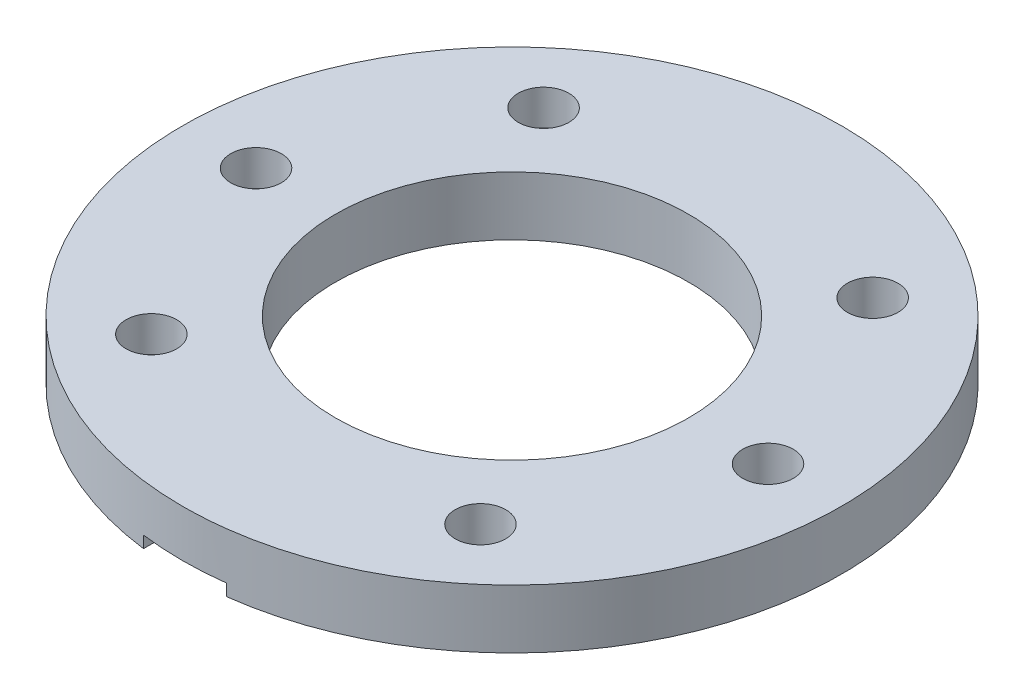
ISO-10303-21;
HEADER;
FILE_DESCRIPTION(('STEP AP214'),'2;1');
FILE_NAME('part.step','',(''),(''),'','','');
FILE_SCHEMA(('AUTOMOTIVE_DESIGN { 1 0 10303 214 1 1 1 1 }'));
ENDSEC;
DATA;
#1=APPLICATION_CONTEXT('core data for automotive mechanical design processes');
#2=APPLICATION_PROTOCOL_DEFINITION('international standard','automotive_design',2000,#1);
#3=PRODUCT_CONTEXT('',#1,'mechanical');
#4=PRODUCT('Part','Part','',(#3));
#5=PRODUCT_RELATED_PRODUCT_CATEGORY('part','',(#4));
#6=PRODUCT_DEFINITION_FORMATION('','',#4);
#7=PRODUCT_DEFINITION_CONTEXT('part definition',#1,'design');
#8=PRODUCT_DEFINITION('design','',#6,#7);
#9=PRODUCT_DEFINITION_SHAPE('','',#8);
#10=(LENGTH_UNIT() NAMED_UNIT(*) SI_UNIT(.MILLI.,.METRE.));
#11=(NAMED_UNIT(*) PLANE_ANGLE_UNIT() SI_UNIT($,.RADIAN.));
#12=(NAMED_UNIT(*) SI_UNIT($,.STERADIAN.) SOLID_ANGLE_UNIT());
#13=UNCERTAINTY_MEASURE_WITH_UNIT(LENGTH_MEASURE(1.E-05),#10,'distance_accuracy_value','');
#14=(GEOMETRIC_REPRESENTATION_CONTEXT(3) GLOBAL_UNCERTAINTY_ASSIGNED_CONTEXT((#13)) GLOBAL_UNIT_ASSIGNED_CONTEXT((#10,
#11,#12)) REPRESENTATION_CONTEXT('',''));
#15=CARTESIAN_POINT('',(0.,0.,0.));
#16=DIRECTION('',(0.,0.,1.));
#17=DIRECTION('',(1.,0.,0.));
#18=AXIS2_PLACEMENT_3D('',#15,#16,#17);
#19=CARTESIAN_POINT('',(-13.9806305106823,5.,16.6614666378378));
#20=DIRECTION('',(0.,-1.,0.));
#21=DIRECTION('',(0.,0.,-1.));
#22=AXIS2_PLACEMENT_3D('',#19,#20,#21);
#23=CYLINDRICAL_SURFACE('',#22,2.15);
#24=CARTESIAN_POINT('',(-13.9806305106823,5.,16.6614666378378));
#25=DIRECTION('',(0.,1.,0.));
#26=DIRECTION('',(0.,0.,1.));
#27=AXIS2_PLACEMENT_3D('',#24,#25,#26);
#28=CIRCLE('',#27,2.15);
#29=CARTESIAN_POINT('',(-13.9806305106823,5.,18.8114666378377));
#30=VERTEX_POINT('',#29);
#31=EDGE_CURVE('E234',#30,#30,#28,.T.);
#32=ORIENTED_EDGE('',*,*,#31,.T.);
#33=EDGE_LOOP('',(#32));
#34=FACE_BOUND('',#33,.T.);
#35=CARTESIAN_POINT('',(-13.9806305106823,2.,16.6614666378378));
#36=DIRECTION('',(0.,-1.,0.));
#37=DIRECTION('',(0.,0.,-1.));
#38=AXIS2_PLACEMENT_3D('',#35,#36,#37);
#39=CIRCLE('',#38,2.15);
#40=CARTESIAN_POINT('',(-13.9806305106823,2.,14.5114666378378));
#41=VERTEX_POINT('',#40);
#42=EDGE_CURVE('E43',#41,#41,#39,.T.);
#43=ORIENTED_EDGE('',*,*,#42,.T.);
#44=EDGE_LOOP('',(#43));
#45=FACE_BOUND('',#44,.T.);
#46=ADVANCED_FACE('F39',(#34,#45),#23,.F.);
#47=CARTESIAN_POINT('',(-21.75,5.,0.));
#48=DIRECTION('',(0.,-1.,0.));
#49=DIRECTION('',(0.,0.,-1.));
#50=AXIS2_PLACEMENT_3D('',#47,#48,#49);
#51=CYLINDRICAL_SURFACE('',#50,2.15);
#52=CARTESIAN_POINT('',(-21.75,5.,0.));
#53=DIRECTION('',(0.,1.,0.));
#54=DIRECTION('',(0.,0.,-1.));
#55=AXIS2_PLACEMENT_3D('',#52,#53,#54);
#56=CIRCLE('',#55,2.15);
#57=CARTESIAN_POINT('',(-21.75,5.,-2.15));
#58=VERTEX_POINT('',#57);
#59=EDGE_CURVE('E230',#58,#58,#56,.T.);
#60=ORIENTED_EDGE('',*,*,#59,.T.);
#61=EDGE_LOOP('',(#60));
#62=FACE_BOUND('',#61,.T.);
#63=CARTESIAN_POINT('',(-21.75,2.,0.));
#64=DIRECTION('',(0.,-1.,0.));
#65=DIRECTION('',(0.,0.,-1.));
#66=AXIS2_PLACEMENT_3D('',#63,#64,#65);
#67=CIRCLE('',#66,2.15);
#68=CARTESIAN_POINT('',(-21.75,2.,-2.15));
#69=VERTEX_POINT('',#68);
#70=EDGE_CURVE('E201',#69,#69,#67,.T.);
#71=ORIENTED_EDGE('',*,*,#70,.T.);
#72=EDGE_LOOP('',(#71));
#73=FACE_BOUND('',#72,.T.);
#74=ADVANCED_FACE('F105',(#62,#73),#51,.F.);
#75=CARTESIAN_POINT('',(-13.9806305106823,5.,-16.6614666378378));
#76=DIRECTION('',(0.,-1.,0.));
#77=DIRECTION('',(0.,0.,-1.));
#78=AXIS2_PLACEMENT_3D('',#75,#76,#77);
#79=CYLINDRICAL_SURFACE('',#78,2.15);
#80=CARTESIAN_POINT('',(-13.9806305106823,5.,-16.6614666378378));
#81=DIRECTION('',(0.,1.,0.));
#82=DIRECTION('',(0.,0.,-1.));
#83=AXIS2_PLACEMENT_3D('',#80,#81,#82);
#84=CIRCLE('',#83,2.15);
#85=CARTESIAN_POINT('',(-13.9806305106823,5.,-18.8114666378377));
#86=VERTEX_POINT('',#85);
#87=EDGE_CURVE('E220',#86,#86,#84,.T.);
#88=ORIENTED_EDGE('',*,*,#87,.T.);
#89=EDGE_LOOP('',(#88));
#90=FACE_BOUND('',#89,.T.);
#91=CARTESIAN_POINT('',(-13.9806305106823,2.,-16.6614666378378));
#92=DIRECTION('',(0.,-1.,0.));
#93=DIRECTION('',(0.,0.,-1.));
#94=AXIS2_PLACEMENT_3D('',#91,#92,#93);
#95=CIRCLE('',#94,2.15);
#96=CARTESIAN_POINT('',(-13.9806305106823,2.,-18.8114666378377));
#97=VERTEX_POINT('',#96);
#98=EDGE_CURVE('E198',#97,#97,#95,.T.);
#99=ORIENTED_EDGE('',*,*,#98,.T.);
#100=EDGE_LOOP('',(#99));
#101=FACE_BOUND('',#100,.T.);
#102=ADVANCED_FACE('F111',(#90,#101),#79,.F.);
#103=CARTESIAN_POINT('',(0.,0.,0.));
#104=DIRECTION('',(0.,1.,0.));
#105=DIRECTION('',(0.,0.,1.));
#106=AXIS2_PLACEMENT_3D('',#103,#104,#105);
#107=PLANE('',#106);
#108=CARTESIAN_POINT('',(-13.9806305106823,0.,-16.6614666378378));
#109=DIRECTION('',(0.,-1.,0.));
#110=DIRECTION('',(0.,0.,-1.));
#111=AXIS2_PLACEMENT_3D('',#108,#109,#110);
#112=CIRCLE('',#111,5.);
#113=CARTESIAN_POINT('',(-13.9806305106823,0.,-21.6614666378378));
#114=VERTEX_POINT('',#113);
#115=EDGE_CURVE('E150',#114,#114,#112,.T.);
#116=ORIENTED_EDGE('',*,*,#115,.F.);
#117=EDGE_LOOP('',(#116));
#118=FACE_BOUND('',#117,.T.);
#119=CARTESIAN_POINT('',(-21.75,0.,0.));
#120=DIRECTION('',(0.,-1.,0.));
#121=DIRECTION('',(0.,0.,-1.));
#122=AXIS2_PLACEMENT_3D('',#119,#120,#121);
#123=CIRCLE('',#122,5.);
#124=CARTESIAN_POINT('',(-21.75,0.,-5.));
#125=VERTEX_POINT('',#124);
#126=EDGE_CURVE('E154',#125,#125,#123,.T.);
#127=ORIENTED_EDGE('',*,*,#126,.F.);
#128=EDGE_LOOP('',(#127));
#129=FACE_BOUND('',#128,.T.);
#130=CARTESIAN_POINT('',(-13.9806305106823,0.,16.6614666378378));
#131=DIRECTION('',(0.,-1.,0.));
#132=DIRECTION('',(0.,0.,-1.));
#133=AXIS2_PLACEMENT_3D('',#130,#131,#132);
#134=CIRCLE('',#133,5.);
#135=CARTESIAN_POINT('',(-13.9806305106823,0.,11.6614666378377));
#136=VERTEX_POINT('',#135);
#137=EDGE_CURVE('E158',#136,#136,#134,.T.);
#138=ORIENTED_EDGE('',*,*,#137,.F.);
#139=EDGE_LOOP('',(#138));
#140=FACE_BOUND('',#139,.T.);
#141=CARTESIAN_POINT('',(13.9806305106823,0.,16.6614666378378));
#142=DIRECTION('',(0.,1.,0.));
#143=DIRECTION('',(0.,0.,-1.));
#144=AXIS2_PLACEMENT_3D('',#141,#142,#143);
#145=CIRCLE('',#144,2.15);
#146=CARTESIAN_POINT('',(13.9806305106823,0.,14.5114666378378));
#147=VERTEX_POINT('',#146);
#148=EDGE_CURVE('E162',#147,#147,#145,.T.);
#149=ORIENTED_EDGE('',*,*,#148,.T.);
#150=EDGE_LOOP('',(#149));
#151=FACE_BOUND('',#150,.T.);
#152=CARTESIAN_POINT('',(21.75,0.,0.));
#153=DIRECTION('',(0.,1.,0.));
#154=DIRECTION('',(0.,0.,1.));
#155=AXIS2_PLACEMENT_3D('',#152,#153,#154);
#156=CIRCLE('',#155,2.15);
#157=CARTESIAN_POINT('',(21.75,0.,2.15));
#158=VERTEX_POINT('',#157);
#159=EDGE_CURVE('E166',#158,#158,#156,.T.);
#160=ORIENTED_EDGE('',*,*,#159,.T.);
#161=EDGE_LOOP('',(#160));
#162=FACE_BOUND('',#161,.T.);
#163=CARTESIAN_POINT('',(13.9806305106823,0.,-16.6614666378378));
#164=DIRECTION('',(0.,1.,0.));
#165=DIRECTION('',(0.,0.,1.));
#166=AXIS2_PLACEMENT_3D('',#163,#164,#165);
#167=CIRCLE('',#166,2.15);
#168=CARTESIAN_POINT('',(13.9806305106823,0.,-14.5114666378378));
#169=VERTEX_POINT('',#168);
#170=EDGE_CURVE('E170',#169,#169,#167,.T.);
#171=ORIENTED_EDGE('',*,*,#170,.T.);
#172=EDGE_LOOP('',(#171));
#173=FACE_BOUND('',#172,.T.);
#174=CARTESIAN_POINT('',(0.,0.,0.));
#175=DIRECTION('',(0.,1.,0.));
#176=DIRECTION('',(0.,0.,1.));
#177=AXIS2_PLACEMENT_3D('',#174,#175,#176);
#178=CIRCLE('',#177,15.);
#179=CARTESIAN_POINT('',(0.,0.,15.));
#180=VERTEX_POINT('',#179);
#181=EDGE_CURVE('E174',#180,#180,#178,.T.);
#182=ORIENTED_EDGE('',*,*,#181,.T.);
#183=EDGE_LOOP('',(#182));
#184=FACE_BOUND('',#183,.T.);
#185=DIRECTION('',(0.,0.,1.));
#186=VECTOR('',#185,1.);
#187=CARTESIAN_POINT('',(-3.53553390593271,0.,0.));
#188=LINE('',#187,#186);
#189=CARTESIAN_POINT('',(-3.53553390593271,0.,26.5355339059328));
#190=VERTEX_POINT('',#189);
#191=CARTESIAN_POINT('',(-3.53553390593271,0.,27.7758888246623));
#192=VERTEX_POINT('',#191);
#193=EDGE_CURVE('E83',#190,#192,#188,.T.);
#194=ORIENTED_EDGE('',*,*,#193,.T.);
#195=CARTESIAN_POINT('',(0.,0.,0.));
#196=DIRECTION('',(0.,1.,0.));
#197=DIRECTION('',(0.,0.,1.));
#198=AXIS2_PLACEMENT_3D('',#195,#196,#197);
#199=CIRCLE('',#198,28.);
#200=CARTESIAN_POINT('',(3.53553390593278,0.,27.7758888246623));
#201=VERTEX_POINT('',#200);
#202=EDGE_CURVE('E49',#201,#192,#199,.T.);
#203=ORIENTED_EDGE('',*,*,#202,.F.);
#204=DIRECTION('',(0.,0.,1.));
#205=VECTOR('',#204,1.);
#206=CARTESIAN_POINT('',(3.53553390593278,0.,0.));
#207=LINE('',#206,#205);
#208=CARTESIAN_POINT('',(3.53553390593278,0.,26.5355339059327));
#209=VERTEX_POINT('',#208);
#210=EDGE_CURVE('E182',#209,#201,#207,.T.);
#211=ORIENTED_EDGE('',*,*,#210,.F.);
#212=CARTESIAN_POINT('',(0.,0.,23.));
#213=DIRECTION('',(0.,-1.,0.));
#214=DIRECTION('',(0.,0.,-1.));
#215=AXIS2_PLACEMENT_3D('',#212,#213,#214);
#216=CIRCLE('',#215,5.);
#217=EDGE_CURVE('E179',#209,#190,#216,.F.);
#218=ORIENTED_EDGE('',*,*,#217,.T.);
#219=EDGE_LOOP('',(#194,#203,#211,#218));
#220=FACE_BOUND('',#219,.T.);
#221=ADVANCED_FACE('F138',(#118,#129,#140,#151,#162,#173,#184,#220),#107,.F.);
#222=CARTESIAN_POINT('',(0.,5.,0.));
#223=DIRECTION('',(0.,-1.,0.));
#224=DIRECTION('',(0.,0.,-1.));
#225=AXIS2_PLACEMENT_3D('',#222,#223,#224);
#226=CYLINDRICAL_SURFACE('',#225,28.);
#227=CARTESIAN_POINT('',(0.,5.,0.));
#228=DIRECTION('',(0.,1.,0.));
#229=DIRECTION('',(0.,0.,1.));
#230=AXIS2_PLACEMENT_3D('',#227,#228,#229);
#231=CIRCLE('',#230,28.);
#232=CARTESIAN_POINT('',(0.,5.,28.));
#233=VERTEX_POINT('',#232);
#234=EDGE_CURVE('E11',#233,#233,#231,.T.);
#235=ORIENTED_EDGE('',*,*,#234,.F.);
#236=EDGE_LOOP('',(#235));
#237=FACE_BOUND('',#236,.T.);
#238=DIRECTION('',(0.,-1.,0.));
#239=VECTOR('',#238,1.);
#240=CARTESIAN_POINT('',(-3.53553390593271,1.,27.7758888246623));
#241=LINE('',#240,#239);
#242=CARTESIAN_POINT('',(-3.53553390593271,1.,27.7758888246623));
#243=VERTEX_POINT('',#242);
#244=EDGE_CURVE('E188',#243,#192,#241,.T.);
#245=ORIENTED_EDGE('',*,*,#244,.F.);
#246=CARTESIAN_POINT('',(0.,1.,0.));
#247=DIRECTION('',(0.,-1.,0.));
#248=DIRECTION('',(0.,0.,-1.));
#249=AXIS2_PLACEMENT_3D('',#246,#247,#248);
#250=CIRCLE('',#249,28.);
#251=CARTESIAN_POINT('',(3.53553390593278,1.,27.7758888246623));
#252=VERTEX_POINT('',#251);
#253=EDGE_CURVE('E257',#252,#243,#250,.T.);
#254=ORIENTED_EDGE('',*,*,#253,.F.);
#255=DIRECTION('',(0.,-1.,0.));
#256=VECTOR('',#255,1.);
#257=CARTESIAN_POINT('',(3.53553390593278,1.,27.7758888246623));
#258=LINE('',#257,#256);
#259=EDGE_CURVE('E189',#252,#201,#258,.T.);
#260=ORIENTED_EDGE('',*,*,#259,.T.);
#261=ORIENTED_EDGE('',*,*,#202,.T.);
#262=EDGE_LOOP('',(#245,#254,#260,#261));
#263=FACE_BOUND('',#262,.T.);
#264=ADVANCED_FACE('F41',(#237,#263),#226,.T.);
#265=CARTESIAN_POINT('',(0.,5.,0.));
#266=DIRECTION('',(0.,1.,0.));
#267=DIRECTION('',(0.,0.,1.));
#268=AXIS2_PLACEMENT_3D('',#265,#266,#267);
#269=PLANE('',#268);
#270=ORIENTED_EDGE('',*,*,#59,.F.);
#271=EDGE_LOOP('',(#270));
#272=FACE_BOUND('',#271,.T.);
#273=CARTESIAN_POINT('',(13.9806305106823,5.,16.6614666378378));
#274=DIRECTION('',(0.,1.,0.));
#275=DIRECTION('',(0.,0.,-1.));
#276=AXIS2_PLACEMENT_3D('',#273,#274,#275);
#277=CIRCLE('',#276,2.15);
#278=CARTESIAN_POINT('',(13.9806305106823,5.,14.5114666378378));
#279=VERTEX_POINT('',#278);
#280=EDGE_CURVE('E237',#279,#279,#277,.T.);
#281=ORIENTED_EDGE('',*,*,#280,.F.);
#282=EDGE_LOOP('',(#281));
#283=FACE_BOUND('',#282,.T.);
#284=CARTESIAN_POINT('',(13.9806305106823,5.,-16.6614666378378));
#285=DIRECTION('',(0.,1.,0.));
#286=DIRECTION('',(0.,0.,1.));
#287=AXIS2_PLACEMENT_3D('',#284,#285,#286);
#288=CIRCLE('',#287,2.15);
#289=CARTESIAN_POINT('',(13.9806305106823,5.,-14.5114666378378));
#290=VERTEX_POINT('',#289);
#291=EDGE_CURVE('E249',#290,#290,#288,.T.);
#292=ORIENTED_EDGE('',*,*,#291,.F.);
#293=EDGE_LOOP('',(#292));
#294=FACE_BOUND('',#293,.T.);
#295=ORIENTED_EDGE('',*,*,#234,.T.);
#296=EDGE_LOOP('',(#295));
#297=FACE_BOUND('',#296,.T.);
#298=CARTESIAN_POINT('',(0.,5.,0.));
#299=DIRECTION('',(0.,1.,0.));
#300=DIRECTION('',(0.,0.,1.));
#301=AXIS2_PLACEMENT_3D('',#298,#299,#300);
#302=CIRCLE('',#301,15.);
#303=CARTESIAN_POINT('',(0.,5.,15.));
#304=VERTEX_POINT('',#303);
#305=EDGE_CURVE('E191',#304,#304,#302,.T.);
#306=ORIENTED_EDGE('',*,*,#305,.F.);
#307=EDGE_LOOP('',(#306));
#308=FACE_BOUND('',#307,.T.);
#309=CARTESIAN_POINT('',(21.75,5.,0.));
#310=DIRECTION('',(0.,1.,0.));
#311=DIRECTION('',(0.,0.,1.));
#312=AXIS2_PLACEMENT_3D('',#309,#310,#311);
#313=CIRCLE('',#312,2.15);
#314=CARTESIAN_POINT('',(21.75,5.,2.15));
#315=VERTEX_POINT('',#314);
#316=EDGE_CURVE('E243',#315,#315,#313,.T.);
#317=ORIENTED_EDGE('',*,*,#316,.F.);
#318=EDGE_LOOP('',(#317));
#319=FACE_BOUND('',#318,.T.);
#320=ORIENTED_EDGE('',*,*,#31,.F.);
#321=EDGE_LOOP('',(#320));
#322=FACE_BOUND('',#321,.T.);
#323=ORIENTED_EDGE('',*,*,#87,.F.);
#324=EDGE_LOOP('',(#323));
#325=FACE_BOUND('',#324,.T.);
#326=ADVANCED_FACE('F134',(#272,#283,#294,#297,#308,#319,#322,#325),#269,.T.);
#327=CARTESIAN_POINT('',(0.,5.,0.));
#328=DIRECTION('',(0.,-1.,0.));
#329=DIRECTION('',(0.,0.,-1.));
#330=AXIS2_PLACEMENT_3D('',#327,#328,#329);
#331=CYLINDRICAL_SURFACE('',#330,15.);
#332=ORIENTED_EDGE('',*,*,#305,.T.);
#333=EDGE_LOOP('',(#332));
#334=FACE_BOUND('',#333,.T.);
#335=ORIENTED_EDGE('',*,*,#181,.F.);
#336=EDGE_LOOP('',(#335));
#337=FACE_BOUND('',#336,.T.);
#338=ADVANCED_FACE('F130',(#334,#337),#331,.F.);
#339=CARTESIAN_POINT('',(13.9806305106823,5.,-16.6614666378378));
#340=DIRECTION('',(0.,-1.,0.));
#341=DIRECTION('',(0.,0.,-1.));
#342=AXIS2_PLACEMENT_3D('',#339,#340,#341);
#343=CYLINDRICAL_SURFACE('',#342,2.15);
#344=ORIENTED_EDGE('',*,*,#291,.T.);
#345=EDGE_LOOP('',(#344));
#346=FACE_BOUND('',#345,.T.);
#347=ORIENTED_EDGE('',*,*,#170,.F.);
#348=EDGE_LOOP('',(#347));
#349=FACE_BOUND('',#348,.T.);
#350=ADVANCED_FACE('F126',(#346,#349),#343,.F.);
#351=CARTESIAN_POINT('',(21.75,5.,0.));
#352=DIRECTION('',(0.,-1.,0.));
#353=DIRECTION('',(0.,0.,-1.));
#354=AXIS2_PLACEMENT_3D('',#351,#352,#353);
#355=CYLINDRICAL_SURFACE('',#354,2.15);
#356=ORIENTED_EDGE('',*,*,#316,.T.);
#357=EDGE_LOOP('',(#356));
#358=FACE_BOUND('',#357,.T.);
#359=ORIENTED_EDGE('',*,*,#159,.F.);
#360=EDGE_LOOP('',(#359));
#361=FACE_BOUND('',#360,.T.);
#362=ADVANCED_FACE('F122',(#358,#361),#355,.F.);
#363=CARTESIAN_POINT('',(13.9806305106823,5.,16.6614666378378));
#364=DIRECTION('',(0.,-1.,0.));
#365=DIRECTION('',(0.,0.,-1.));
#366=AXIS2_PLACEMENT_3D('',#363,#364,#365);
#367=CYLINDRICAL_SURFACE('',#366,2.15);
#368=ORIENTED_EDGE('',*,*,#280,.T.);
#369=EDGE_LOOP('',(#368));
#370=FACE_BOUND('',#369,.T.);
#371=ORIENTED_EDGE('',*,*,#148,.F.);
#372=EDGE_LOOP('',(#371));
#373=FACE_BOUND('',#372,.T.);
#374=ADVANCED_FACE('F118',(#370,#373),#367,.F.);
#375=CARTESIAN_POINT('',(0.,1.,23.));
#376=DIRECTION('',(0.,-1.,0.));
#377=DIRECTION('',(0.,0.,-1.));
#378=AXIS2_PLACEMENT_3D('',#375,#376,#377);
#379=CYLINDRICAL_SURFACE('',#378,5.);
#380=ORIENTED_EDGE('',*,*,#217,.F.);
#381=DIRECTION('',(0.,-1.,0.));
#382=VECTOR('',#381,1.);
#383=CARTESIAN_POINT('',(3.53553390593278,1.,26.5355339059327));
#384=LINE('',#383,#382);
#385=CARTESIAN_POINT('',(3.53553390593278,1.,26.5355339059327));
#386=VERTEX_POINT('',#385);
#387=EDGE_CURVE('E88',#386,#209,#384,.T.);
#388=ORIENTED_EDGE('',*,*,#387,.F.);
#389=CARTESIAN_POINT('',(0.,1.,23.));
#390=DIRECTION('',(0.,-1.,0.));
#391=DIRECTION('',(0.,0.,-1.));
#392=AXIS2_PLACEMENT_3D('',#389,#390,#391);
#393=CIRCLE('',#392,5.);
#394=CARTESIAN_POINT('',(-3.53553390593271,1.,26.5355339059328));
#395=VERTEX_POINT('',#394);
#396=EDGE_CURVE('E181',#386,#395,#393,.F.);
#397=ORIENTED_EDGE('',*,*,#396,.T.);
#398=DIRECTION('',(0.,-1.,0.));
#399=VECTOR('',#398,1.);
#400=CARTESIAN_POINT('',(-3.53553390593271,1.,26.5355339059328));
#401=LINE('',#400,#399);
#402=EDGE_CURVE('E217',#395,#190,#401,.T.);
#403=ORIENTED_EDGE('',*,*,#402,.T.);
#404=EDGE_LOOP('',(#380,#388,#397,#403));
#405=FACE_BOUND('',#404,.T.);
#406=ADVANCED_FACE('F121',(#405),#379,.F.);
#407=CARTESIAN_POINT('',(-3.53553390593271,1.,0.));
#408=DIRECTION('',(1.,0.,0.));
#409=DIRECTION('',(0.,0.,-1.));
#410=AXIS2_PLACEMENT_3D('',#407,#408,#409);
#411=PLANE('',#410);
#412=ORIENTED_EDGE('',*,*,#193,.F.);
#413=ORIENTED_EDGE('',*,*,#402,.F.);
#414=DIRECTION('',(0.,0.,1.));
#415=VECTOR('',#414,1.);
#416=CARTESIAN_POINT('',(-3.53553390593271,1.,0.));
#417=LINE('',#416,#415);
#418=EDGE_CURVE('E63',#395,#243,#417,.T.);
#419=ORIENTED_EDGE('',*,*,#418,.T.);
#420=ORIENTED_EDGE('',*,*,#244,.T.);
#421=EDGE_LOOP('',(#412,#413,#419,#420));
#422=FACE_BOUND('',#421,.T.);
#423=ADVANCED_FACE('F296',(#422),#411,.T.);
#424=CARTESIAN_POINT('',(3.53553390593278,1.,0.));
#425=DIRECTION('',(1.,0.,0.));
#426=DIRECTION('',(0.,0.,-1.));
#427=AXIS2_PLACEMENT_3D('',#424,#425,#426);
#428=PLANE('',#427);
#429=ORIENTED_EDGE('',*,*,#210,.T.);
#430=ORIENTED_EDGE('',*,*,#259,.F.);
#431=DIRECTION('',(0.,0.,1.));
#432=VECTOR('',#431,1.);
#433=CARTESIAN_POINT('',(3.53553390593278,1.,0.));
#434=LINE('',#433,#432);
#435=EDGE_CURVE('E57',#386,#252,#434,.T.);
#436=ORIENTED_EDGE('',*,*,#435,.F.);
#437=ORIENTED_EDGE('',*,*,#387,.T.);
#438=EDGE_LOOP('',(#429,#430,#436,#437));
#439=FACE_BOUND('',#438,.T.);
#440=ADVANCED_FACE('F293',(#439),#428,.F.);
#441=CARTESIAN_POINT('',(0.,1.,0.));
#442=DIRECTION('',(0.,-1.,0.));
#443=DIRECTION('',(0.,0.,-1.));
#444=AXIS2_PLACEMENT_3D('',#441,#442,#443);
#445=PLANE('',#444);
#446=CARTESIAN_POINT('',(0.,1.,23.));
#447=DIRECTION('',(0.,-1.,0.));
#448=DIRECTION('',(0.,0.,-1.));
#449=AXIS2_PLACEMENT_3D('',#446,#447,#448);
#450=CIRCLE('',#449,4.5);
#451=CARTESIAN_POINT('',(0.,1.,18.5));
#452=VERTEX_POINT('',#451);
#453=EDGE_CURVE('E281',#452,#452,#450,.T.);
#454=ORIENTED_EDGE('',*,*,#453,.F.);
#455=EDGE_LOOP('',(#454));
#456=FACE_BOUND('',#455,.T.);
#457=ORIENTED_EDGE('',*,*,#396,.F.);
#458=ORIENTED_EDGE('',*,*,#435,.T.);
#459=ORIENTED_EDGE('',*,*,#253,.T.);
#460=ORIENTED_EDGE('',*,*,#418,.F.);
#461=EDGE_LOOP('',(#457,#458,#459,#460));
#462=FACE_BOUND('',#461,.T.);
#463=ADVANCED_FACE('F290',(#456,#462),#445,.T.);
#464=CARTESIAN_POINT('',(-13.9806305106823,2.,-16.6614666378378));
#465=DIRECTION('',(0.,-1.,0.));
#466=DIRECTION('',(0.,0.,-1.));
#467=AXIS2_PLACEMENT_3D('',#464,#465,#466);
#468=CYLINDRICAL_SURFACE('',#467,5.);
#469=CARTESIAN_POINT('',(-13.9806305106823,2.,-16.6614666378378));
#470=DIRECTION('',(0.,-1.,0.));
#471=DIRECTION('',(0.,0.,-1.));
#472=AXIS2_PLACEMENT_3D('',#469,#470,#471);
#473=CIRCLE('',#472,5.);
#474=CARTESIAN_POINT('',(-13.9806305106823,2.,-21.6614666378378));
#475=VERTEX_POINT('',#474);
#476=EDGE_CURVE('E202',#475,#475,#473,.T.);
#477=ORIENTED_EDGE('',*,*,#476,.F.);
#478=EDGE_LOOP('',(#477));
#479=FACE_BOUND('',#478,.T.);
#480=ORIENTED_EDGE('',*,*,#115,.T.);
#481=EDGE_LOOP('',(#480));
#482=FACE_BOUND('',#481,.T.);
#483=ADVANCED_FACE('F292',(#479,#482),#468,.F.);
#484=CARTESIAN_POINT('',(-13.9806305106823,2.,-16.6614666378378));
#485=DIRECTION('',(0.,-1.,0.));
#486=DIRECTION('',(0.,0.,-1.));
#487=AXIS2_PLACEMENT_3D('',#484,#485,#486);
#488=PLANE('',#487);
#489=ORIENTED_EDGE('',*,*,#98,.F.);
#490=EDGE_LOOP('',(#489));
#491=FACE_BOUND('',#490,.T.);
#492=ORIENTED_EDGE('',*,*,#476,.T.);
#493=EDGE_LOOP('',(#492));
#494=FACE_BOUND('',#493,.T.);
#495=ADVANCED_FACE('F320',(#491,#494),#488,.T.);
#496=CARTESIAN_POINT('',(-21.75,2.,0.));
#497=DIRECTION('',(0.,-1.,0.));
#498=DIRECTION('',(0.,0.,-1.));
#499=AXIS2_PLACEMENT_3D('',#496,#497,#498);
#500=CYLINDRICAL_SURFACE('',#499,5.);
#501=CARTESIAN_POINT('',(-21.75,2.,0.));
#502=DIRECTION('',(0.,-1.,0.));
#503=DIRECTION('',(0.,0.,-1.));
#504=AXIS2_PLACEMENT_3D('',#501,#502,#503);
#505=CIRCLE('',#504,5.);
#506=CARTESIAN_POINT('',(-21.75,2.,-5.));
#507=VERTEX_POINT('',#506);
#508=EDGE_CURVE('E270',#507,#507,#505,.T.);
#509=ORIENTED_EDGE('',*,*,#508,.F.);
#510=EDGE_LOOP('',(#509));
#511=FACE_BOUND('',#510,.T.);
#512=ORIENTED_EDGE('',*,*,#126,.T.);
#513=EDGE_LOOP('',(#512));
#514=FACE_BOUND('',#513,.T.);
#515=ADVANCED_FACE('F316',(#511,#514),#500,.F.);
#516=CARTESIAN_POINT('',(-21.75,2.,0.));
#517=DIRECTION('',(0.,-1.,0.));
#518=DIRECTION('',(0.,0.,-1.));
#519=AXIS2_PLACEMENT_3D('',#516,#517,#518);
#520=PLANE('',#519);
#521=ORIENTED_EDGE('',*,*,#70,.F.);
#522=EDGE_LOOP('',(#521));
#523=FACE_BOUND('',#522,.T.);
#524=ORIENTED_EDGE('',*,*,#508,.T.);
#525=EDGE_LOOP('',(#524));
#526=FACE_BOUND('',#525,.T.);
#527=ADVANCED_FACE('F312',(#523,#526),#520,.T.);
#528=CARTESIAN_POINT('',(-13.9806305106823,2.,16.6614666378378));
#529=DIRECTION('',(0.,-1.,0.));
#530=DIRECTION('',(0.,0.,-1.));
#531=AXIS2_PLACEMENT_3D('',#528,#529,#530);
#532=CYLINDRICAL_SURFACE('',#531,5.);
#533=CARTESIAN_POINT('',(-13.9806305106823,2.,16.6614666378378));
#534=DIRECTION('',(0.,-1.,0.));
#535=DIRECTION('',(0.,0.,-1.));
#536=AXIS2_PLACEMENT_3D('',#533,#534,#535);
#537=CIRCLE('',#536,5.);
#538=CARTESIAN_POINT('',(-13.9806305106823,2.,11.6614666378377));
#539=VERTEX_POINT('',#538);
#540=EDGE_CURVE('E263',#539,#539,#537,.T.);
#541=ORIENTED_EDGE('',*,*,#540,.F.);
#542=EDGE_LOOP('',(#541));
#543=FACE_BOUND('',#542,.T.);
#544=ORIENTED_EDGE('',*,*,#137,.T.);
#545=EDGE_LOOP('',(#544));
#546=FACE_BOUND('',#545,.T.);
#547=ADVANCED_FACE('F308',(#543,#546),#532,.F.);
#548=CARTESIAN_POINT('',(-13.9806305106823,2.,16.6614666378378));
#549=DIRECTION('',(0.,-1.,0.));
#550=DIRECTION('',(0.,0.,-1.));
#551=AXIS2_PLACEMENT_3D('',#548,#549,#550);
#552=PLANE('',#551);
#553=ORIENTED_EDGE('',*,*,#42,.F.);
#554=EDGE_LOOP('',(#553));
#555=FACE_BOUND('',#554,.T.);
#556=ORIENTED_EDGE('',*,*,#540,.T.);
#557=EDGE_LOOP('',(#556));
#558=FACE_BOUND('',#557,.T.);
#559=ADVANCED_FACE('F100',(#555,#558),#552,.T.);
#560=CARTESIAN_POINT('',(0.,2.,23.));
#561=DIRECTION('',(0.,-1.,0.));
#562=DIRECTION('',(0.,0.,-1.));
#563=AXIS2_PLACEMENT_3D('',#560,#561,#562);
#564=CYLINDRICAL_SURFACE('',#563,4.5);
#565=CARTESIAN_POINT('',(0.,2.,23.));
#566=DIRECTION('',(0.,-1.,0.));
#567=DIRECTION('',(0.,0.,-1.));
#568=AXIS2_PLACEMENT_3D('',#565,#566,#567);
#569=CIRCLE('',#568,4.5);
#570=CARTESIAN_POINT('',(0.,2.,18.5));
#571=VERTEX_POINT('',#570);
#572=EDGE_CURVE('E267',#571,#571,#569,.T.);
#573=ORIENTED_EDGE('',*,*,#572,.F.);
#574=EDGE_LOOP('',(#573));
#575=FACE_BOUND('',#574,.T.);
#576=ORIENTED_EDGE('',*,*,#453,.T.);
#577=EDGE_LOOP('',(#576));
#578=FACE_BOUND('',#577,.T.);
#579=ADVANCED_FACE('F94',(#575,#578),#564,.F.);
#580=CARTESIAN_POINT('',(0.,1.,23.));
#581=DIRECTION('',(0.,1.,0.));
#582=DIRECTION('',(0.,0.,1.));
#583=AXIS2_PLACEMENT_3D('',#580,#581,#582);
#584=CONICAL_SURFACE('',#583,0.,1.35212738092095);
#585=ORIENTED_EDGE('',*,*,#572,.T.);
#586=EDGE_LOOP('',(#585));
#587=FACE_BOUND('',#586,.T.);
#588=CARTESIAN_POINT('',(0.,1.,23.));
#589=VERTEX_POINT('',#588);
#590=VERTEX_LOOP('',#589);
#591=FACE_BOUND('',#590,.T.);
#592=ADVANCED_FACE('F92',(#587,#591),#584,.T.);
#593=CLOSED_SHELL('',(#46,#74,#102,#221,#264,#326,#338,#350,#362,#374,#406,#423,#440,#463,#483,
#495,#515,#527,#547,#559,#579,#592));
#594=MANIFOLD_SOLID_BREP('B2',#593);
#595=ADVANCED_BREP_SHAPE_REPRESENTATION('',(#18,#594),#14);
#596=SHAPE_DEFINITION_REPRESENTATION(#9,#595);
ENDSEC;
END-ISO-10303-21;
